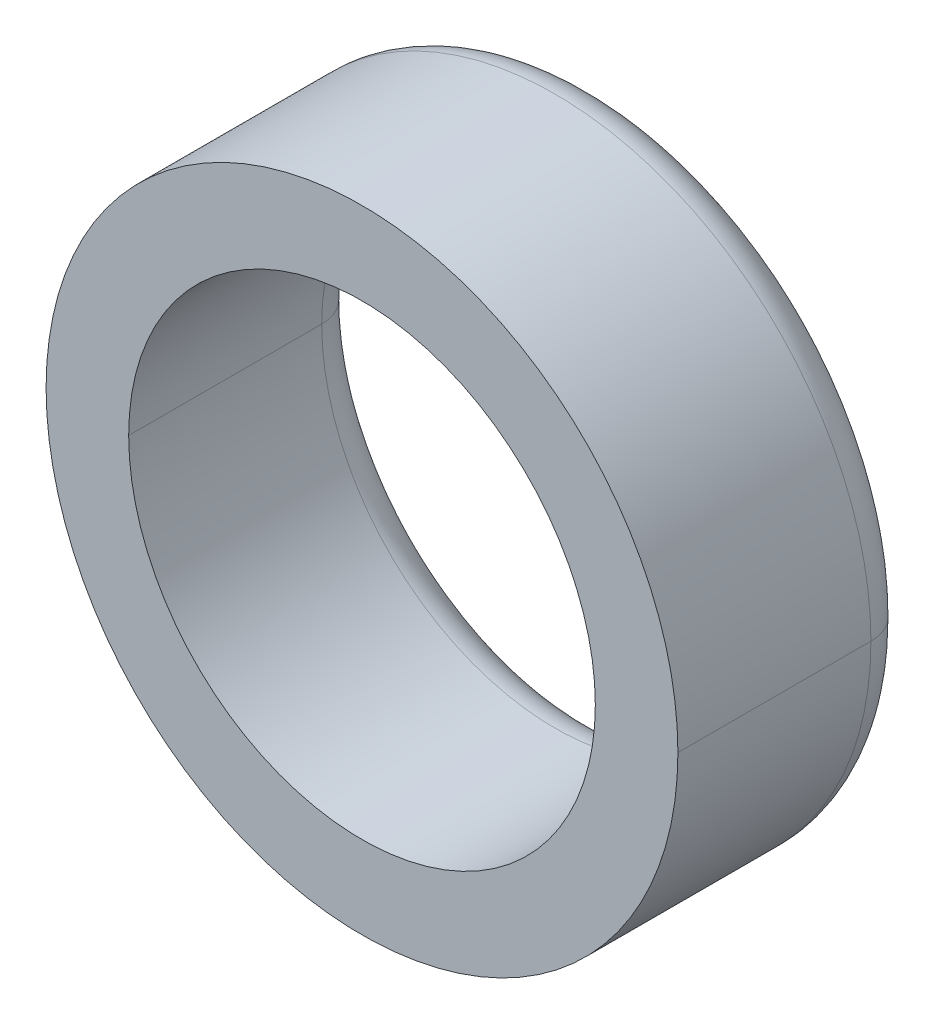
ISO-10303-21;
HEADER;
FILE_DESCRIPTION(('STEP AP214'),'2;1');
FILE_NAME('part.step','',(''),(''),'','','');
FILE_SCHEMA(('AUTOMOTIVE_DESIGN { 1 0 10303 214 1 1 1 1 }'));
ENDSEC;
DATA;
#1=APPLICATION_CONTEXT('core data for automotive mechanical design processes');
#2=APPLICATION_PROTOCOL_DEFINITION('international standard','automotive_design',2000,#1);
#3=PRODUCT_CONTEXT('',#1,'mechanical');
#4=PRODUCT('Part','Part','',(#3));
#5=PRODUCT_RELATED_PRODUCT_CATEGORY('part','',(#4));
#6=PRODUCT_DEFINITION_FORMATION('','',#4);
#7=PRODUCT_DEFINITION_CONTEXT('part definition',#1,'design');
#8=PRODUCT_DEFINITION('design','',#6,#7);
#9=PRODUCT_DEFINITION_SHAPE('','',#8);
#10=(LENGTH_UNIT() NAMED_UNIT(*) SI_UNIT(.MILLI.,.METRE.));
#11=(NAMED_UNIT(*) PLANE_ANGLE_UNIT() SI_UNIT($,.RADIAN.));
#12=(NAMED_UNIT(*) SI_UNIT($,.STERADIAN.) SOLID_ANGLE_UNIT());
#13=UNCERTAINTY_MEASURE_WITH_UNIT(LENGTH_MEASURE(1.E-05),#10,'distance_accuracy_value','');
#14=(GEOMETRIC_REPRESENTATION_CONTEXT(3) GLOBAL_UNCERTAINTY_ASSIGNED_CONTEXT((#13)) GLOBAL_UNIT_ASSIGNED_CONTEXT((#10,
#11,#12)) REPRESENTATION_CONTEXT('',''));
#15=CARTESIAN_POINT('',(0.,0.,0.));
#16=DIRECTION('',(0.,0.,1.));
#17=DIRECTION('',(1.,0.,0.));
#18=AXIS2_PLACEMENT_3D('',#15,#16,#17);
#19=CARTESIAN_POINT('',(0.,0.,-6.1));
#20=DIRECTION('',(0.,0.,1.));
#21=DIRECTION('',(1.,0.,0.));
#22=AXIS2_PLACEMENT_3D('',#19,#20,#21);
#23=CYLINDRICAL_SURFACE('',#22,8.225);
#24=CARTESIAN_POINT('',(0.,0.,-5.025));
#25=DIRECTION('',(0.,0.,1.));
#26=DIRECTION('',(1.,0.,0.));
#27=AXIS2_PLACEMENT_3D('',#24,#25,#26);
#28=CIRCLE('',#27,8.225);
#29=CARTESIAN_POINT('',(8.225,0.,-5.02500000075));
#30=VERTEX_POINT('',#29);
#31=CARTESIAN_POINT('',(-8.225,0.,-5.02500000075));
#32=VERTEX_POINT('',#31);
#33=EDGE_CURVE('E147',#30,#32,#28,.T.);
#34=ORIENTED_EDGE('',*,*,#33,.T.);
#35=DIRECTION('',(0.,0.,1.));
#36=VECTOR('',#35,1.);
#37=CARTESIAN_POINT('',(-8.225,0.,-6.09999999963));
#38=LINE('',#37,#36);
#39=CARTESIAN_POINT('',(-8.225,0.,-3.72528674575E-10));
#40=VERTEX_POINT('',#39);
#41=EDGE_CURVE('E29',#32,#40,#38,.T.);
#42=ORIENTED_EDGE('',*,*,#41,.T.);
#43=CARTESIAN_POINT('',(0.,0.,0.));
#44=DIRECTION('',(0.,0.,1.));
#45=DIRECTION('',(1.,0.,0.));
#46=AXIS2_PLACEMENT_3D('',#43,#44,#45);
#47=CIRCLE('',#46,8.22499999963);
#48=CARTESIAN_POINT('',(8.225,0.,-3.72528674575E-10));
#49=VERTEX_POINT('',#48);
#50=EDGE_CURVE('E91',#49,#40,#47,.T.);
#51=ORIENTED_EDGE('',*,*,#50,.F.);
#52=DIRECTION('',(0.,0.,1.));
#53=VECTOR('',#52,1.);
#54=CARTESIAN_POINT('',(8.225,0.,-6.09999999963));
#55=LINE('',#54,#53);
#56=EDGE_CURVE('E11',#30,#49,#55,.T.);
#57=ORIENTED_EDGE('',*,*,#56,.F.);
#58=EDGE_LOOP('',(#34,#42,#51,#57));
#59=FACE_BOUND('',#58,.T.);
#60=ADVANCED_FACE('F17',(#59),#23,.T.);
#61=CARTESIAN_POINT('',(0.,0.,-6.1));
#62=DIRECTION('',(0.,0.,1.));
#63=DIRECTION('',(1.,0.,0.));
#64=AXIS2_PLACEMENT_3D('',#61,#62,#63);
#65=CYLINDRICAL_SURFACE('',#64,8.225);
#66=ORIENTED_EDGE('',*,*,#41,.F.);
#67=CARTESIAN_POINT('',(0.,0.,-5.025));
#68=DIRECTION('',(0.,0.,1.));
#69=DIRECTION('',(1.,0.,0.));
#70=AXIS2_PLACEMENT_3D('',#67,#68,#69);
#71=CIRCLE('',#70,8.225);
#72=EDGE_CURVE('E157',#32,#30,#71,.T.);
#73=ORIENTED_EDGE('',*,*,#72,.T.);
#74=ORIENTED_EDGE('',*,*,#56,.T.);
#75=CARTESIAN_POINT('',(0.,0.,0.));
#76=DIRECTION('',(0.,0.,1.));
#77=DIRECTION('',(1.,0.,0.));
#78=AXIS2_PLACEMENT_3D('',#75,#76,#77);
#79=CIRCLE('',#78,8.22499999963);
#80=EDGE_CURVE('E148',#40,#49,#79,.T.);
#81=ORIENTED_EDGE('',*,*,#80,.F.);
#82=EDGE_LOOP('',(#66,#73,#74,#81));
#83=FACE_BOUND('',#82,.T.);
#84=ADVANCED_FACE('F186',(#83),#65,.T.);
#85=CARTESIAN_POINT('',(0.,0.,-5.025));
#86=DIRECTION('',(0.,0.,1.));
#87=DIRECTION('',(1.,0.,0.));
#88=AXIS2_PLACEMENT_3D('',#85,#86,#87);
#89=TOROIDAL_SURFACE('',#88,7.15,1.075);
#90=CARTESIAN_POINT('',(0.,0.,-5.02500000075));
#91=DIRECTION('',(0.,0.,-1.));
#92=DIRECTION('',(1.,0.,0.));
#93=AXIS2_PLACEMENT_3D('',#90,#91,#92);
#94=CIRCLE('',#93,6.075);
#95=CARTESIAN_POINT('',(-6.075,0.,-5.02500000075));
#96=VERTEX_POINT('',#95);
#97=CARTESIAN_POINT('',(6.075,0.,-5.025));
#98=VERTEX_POINT('',#97);
#99=EDGE_CURVE('E73',#96,#98,#94,.T.);
#100=ORIENTED_EDGE('',*,*,#99,.F.);
#101=CARTESIAN_POINT('',(-7.15,0.,-5.025));
#102=DIRECTION('',(0.,1.,0.));
#103=DIRECTION('',(1.,0.,0.));
#104=AXIS2_PLACEMENT_3D('',#101,#102,#103);
#105=CIRCLE('',#104,1.075);
#106=EDGE_CURVE('E118',#96,#32,#105,.T.);
#107=ORIENTED_EDGE('',*,*,#106,.T.);
#108=ORIENTED_EDGE('',*,*,#33,.F.);
#109=CARTESIAN_POINT('',(7.15,0.,-5.025));
#110=DIRECTION('',(0.,-1.,0.));
#111=DIRECTION('',(1.,0.,0.));
#112=AXIS2_PLACEMENT_3D('',#109,#110,#111);
#113=CIRCLE('',#112,1.075);
#114=EDGE_CURVE('E159',#98,#30,#113,.T.);
#115=ORIENTED_EDGE('',*,*,#114,.F.);
#116=EDGE_LOOP('',(#100,#107,#108,#115));
#117=FACE_BOUND('',#116,.T.);
#118=ADVANCED_FACE('F184',(#117),#89,.T.);
#119=CARTESIAN_POINT('',(0.,0.,0.));
#120=DIRECTION('',(0.,0.,1.));
#121=DIRECTION('',(1.,0.,0.));
#122=AXIS2_PLACEMENT_3D('',#119,#120,#121);
#123=PLANE('',#122);
#124=CARTESIAN_POINT('',(0.,0.,-3.72528674575E-10));
#125=DIRECTION('',(0.,0.,1.));
#126=DIRECTION('',(1.,0.,0.));
#127=AXIS2_PLACEMENT_3D('',#124,#125,#126);
#128=CIRCLE('',#127,6.075);
#129=CARTESIAN_POINT('',(6.075,0.,-3.72528674575E-10));
#130=VERTEX_POINT('',#129);
#131=CARTESIAN_POINT('',(-6.07499999925,0.,0.));
#132=VERTEX_POINT('',#131);
#133=EDGE_CURVE('E80',#130,#132,#128,.T.);
#134=ORIENTED_EDGE('',*,*,#133,.F.);
#135=CARTESIAN_POINT('',(0.,0.,0.));
#136=DIRECTION('',(0.,0.,1.));
#137=DIRECTION('',(-1.,0.,0.));
#138=AXIS2_PLACEMENT_3D('',#135,#136,#137);
#139=CIRCLE('',#138,6.075);
#140=EDGE_CURVE('E93',#132,#130,#139,.T.);
#141=ORIENTED_EDGE('',*,*,#140,.F.);
#142=EDGE_LOOP('',(#134,#141));
#143=FACE_BOUND('',#142,.T.);
#144=ORIENTED_EDGE('',*,*,#50,.T.);
#145=ORIENTED_EDGE('',*,*,#80,.T.);
#146=EDGE_LOOP('',(#144,#145));
#147=FACE_BOUND('',#146,.T.);
#148=ADVANCED_FACE('F19',(#143,#147),#123,.T.);
#149=CARTESIAN_POINT('',(0.,0.,-6.1));
#150=DIRECTION('',(0.,0.,1.));
#151=DIRECTION('',(1.,0.,0.));
#152=AXIS2_PLACEMENT_3D('',#149,#150,#151);
#153=CYLINDRICAL_SURFACE('',#152,6.075);
#154=DIRECTION('',(0.,0.,1.));
#155=VECTOR('',#154,1.);
#156=CARTESIAN_POINT('',(-6.075,0.,-6.09999999963));
#157=LINE('',#156,#155);
#158=EDGE_CURVE('E84',#96,#132,#157,.T.);
#159=ORIENTED_EDGE('',*,*,#158,.F.);
#160=ORIENTED_EDGE('',*,*,#99,.T.);
#161=DIRECTION('',(0.,0.,1.));
#162=VECTOR('',#161,1.);
#163=CARTESIAN_POINT('',(6.075,0.,-6.09999999963));
#164=LINE('',#163,#162);
#165=EDGE_CURVE('E87',#98,#130,#164,.T.);
#166=ORIENTED_EDGE('',*,*,#165,.T.);
#167=ORIENTED_EDGE('',*,*,#133,.T.);
#168=EDGE_LOOP('',(#159,#160,#166,#167));
#169=FACE_BOUND('',#168,.T.);
#170=ADVANCED_FACE('F82',(#169),#153,.F.);
#171=CARTESIAN_POINT('',(0.,0.,-5.025));
#172=DIRECTION('',(0.,0.,1.));
#173=DIRECTION('',(-1.,0.,0.));
#174=AXIS2_PLACEMENT_3D('',#171,#172,#173);
#175=TOROIDAL_SURFACE('',#174,7.15,1.075);
#176=ORIENTED_EDGE('',*,*,#106,.F.);
#177=CARTESIAN_POINT('',(0.,0.,-5.02500000075));
#178=DIRECTION('',(0.,0.,-1.));
#179=DIRECTION('',(1.,0.,0.));
#180=AXIS2_PLACEMENT_3D('',#177,#178,#179);
#181=CIRCLE('',#180,6.075);
#182=EDGE_CURVE('E103',#98,#96,#181,.T.);
#183=ORIENTED_EDGE('',*,*,#182,.F.);
#184=ORIENTED_EDGE('',*,*,#114,.T.);
#185=ORIENTED_EDGE('',*,*,#72,.F.);
#186=EDGE_LOOP('',(#176,#183,#184,#185));
#187=FACE_BOUND('',#186,.T.);
#188=ADVANCED_FACE('F134',(#187),#175,.T.);
#189=CARTESIAN_POINT('',(0.,0.,-6.1));
#190=DIRECTION('',(0.,0.,1.));
#191=DIRECTION('',(1.,0.,0.));
#192=AXIS2_PLACEMENT_3D('',#189,#190,#191);
#193=CYLINDRICAL_SURFACE('',#192,6.075);
#194=ORIENTED_EDGE('',*,*,#182,.T.);
#195=ORIENTED_EDGE('',*,*,#158,.T.);
#196=ORIENTED_EDGE('',*,*,#140,.T.);
#197=ORIENTED_EDGE('',*,*,#165,.F.);
#198=EDGE_LOOP('',(#194,#195,#196,#197));
#199=FACE_BOUND('',#198,.T.);
#200=ADVANCED_FACE('F101',(#199),#193,.F.);
#201=CLOSED_SHELL('',(#60,#84,#118,#148,#170,#188,#200));
#202=MANIFOLD_SOLID_BREP('B1',#201);
#203=ADVANCED_BREP_SHAPE_REPRESENTATION('',(#18,#202),#14);
#204=SHAPE_DEFINITION_REPRESENTATION(#9,#203);
ENDSEC;
END-ISO-10303-21;
